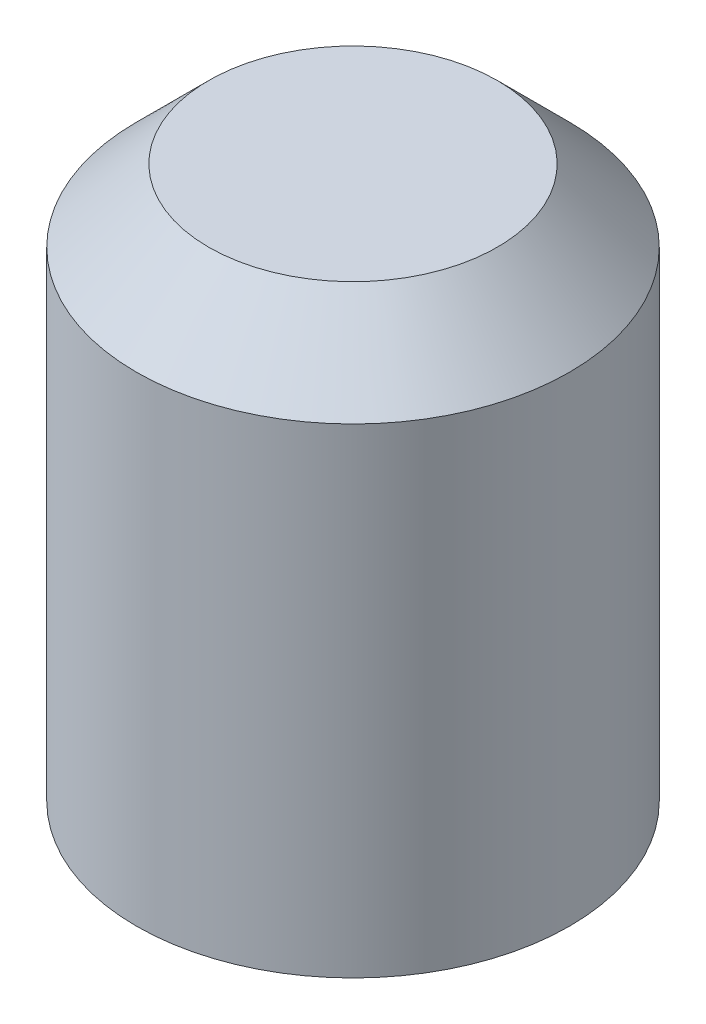
ISO-10303-21;
HEADER;
FILE_DESCRIPTION(('STEP AP214'),'2;1');
FILE_NAME('part.step','',(''),(''),'','','');
FILE_SCHEMA(('AUTOMOTIVE_DESIGN { 1 0 10303 214 1 1 1 1 }'));
ENDSEC;
DATA;
#1=APPLICATION_CONTEXT('core data for automotive mechanical design processes');
#2=APPLICATION_PROTOCOL_DEFINITION('international standard','automotive_design',2000,#1);
#3=PRODUCT_CONTEXT('',#1,'mechanical');
#4=PRODUCT('Part','Part','',(#3));
#5=PRODUCT_RELATED_PRODUCT_CATEGORY('part','',(#4));
#6=PRODUCT_DEFINITION_FORMATION('','',#4);
#7=PRODUCT_DEFINITION_CONTEXT('part definition',#1,'design');
#8=PRODUCT_DEFINITION('design','',#6,#7);
#9=PRODUCT_DEFINITION_SHAPE('','',#8);
#10=(LENGTH_UNIT() NAMED_UNIT(*) SI_UNIT(.MILLI.,.METRE.));
#11=(NAMED_UNIT(*) PLANE_ANGLE_UNIT() SI_UNIT($,.RADIAN.));
#12=(NAMED_UNIT(*) SI_UNIT($,.STERADIAN.) SOLID_ANGLE_UNIT());
#13=UNCERTAINTY_MEASURE_WITH_UNIT(LENGTH_MEASURE(1.E-05),#10,'distance_accuracy_value','');
#14=(GEOMETRIC_REPRESENTATION_CONTEXT(3) GLOBAL_UNCERTAINTY_ASSIGNED_CONTEXT((#13)) GLOBAL_UNIT_ASSIGNED_CONTEXT((#10,
#11,#12)) REPRESENTATION_CONTEXT('',''));
#15=CARTESIAN_POINT('',(0.,0.,0.));
#16=DIRECTION('',(0.,0.,1.));
#17=DIRECTION('',(1.,0.,0.));
#18=AXIS2_PLACEMENT_3D('',#15,#16,#17);
#19=CARTESIAN_POINT('',(5.4,-6.05,0.));
#20=DIRECTION('',(0.,1.,0.));
#21=DIRECTION('',(0.,0.,1.));
#22=AXIS2_PLACEMENT_3D('',#19,#20,#21);
#23=PLANE('',#22);
#24=DIRECTION('',(1.,0.,0.));
#25=VECTOR('',#24,1.);
#26=CARTESIAN_POINT('',(5.83301270189222,-6.05,0.75));
#27=LINE('',#26,#25);
#28=CARTESIAN_POINT('',(5.83301270189222,-6.05,0.75));
#29=VERTEX_POINT('',#28);
#30=CARTESIAN_POINT('',(4.96698729810778,-6.05,0.75));
#31=VERTEX_POINT('',#30);
#32=EDGE_CURVE('E116',#29,#31,#27,.F.);
#33=ORIENTED_EDGE('',*,*,#32,.T.);
#34=DIRECTION('',(0.5,0.,0.866025403784439));
#35=VECTOR('',#34,1.);
#36=CARTESIAN_POINT('',(4.96698729810778,-6.05,0.75));
#37=LINE('',#36,#35);
#38=CARTESIAN_POINT('',(4.53397459621556,-6.05,0.));
#39=VERTEX_POINT('',#38);
#40=EDGE_CURVE('E82',#31,#39,#37,.F.);
#41=ORIENTED_EDGE('',*,*,#40,.T.);
#42=DIRECTION('',(-0.5,0.,0.866025403784439));
#43=VECTOR('',#42,1.);
#44=CARTESIAN_POINT('',(4.53397459621556,-6.05,0.));
#45=LINE('',#44,#43);
#46=CARTESIAN_POINT('',(4.96698729810778,-6.05,-0.75));
#47=VERTEX_POINT('',#46);
#48=EDGE_CURVE('E84',#39,#47,#45,.F.);
#49=ORIENTED_EDGE('',*,*,#48,.T.);
#50=DIRECTION('',(-1.,0.,0.));
#51=VECTOR('',#50,1.);
#52=CARTESIAN_POINT('',(4.96698729810778,-6.05,-0.75));
#53=LINE('',#52,#51);
#54=CARTESIAN_POINT('',(5.83301270189222,-6.05,-0.75));
#55=VERTEX_POINT('',#54);
#56=EDGE_CURVE('E85',#47,#55,#53,.F.);
#57=ORIENTED_EDGE('',*,*,#56,.T.);
#58=DIRECTION('',(-0.5,0.,-0.866025403784439));
#59=VECTOR('',#58,1.);
#60=CARTESIAN_POINT('',(5.83301270189222,-6.05,-0.75));
#61=LINE('',#60,#59);
#62=CARTESIAN_POINT('',(6.26602540378444,-6.05,0.));
#63=VERTEX_POINT('',#62);
#64=EDGE_CURVE('E71',#55,#63,#61,.F.);
#65=ORIENTED_EDGE('',*,*,#64,.T.);
#66=DIRECTION('',(0.5,0.,-0.866025403784439));
#67=VECTOR('',#66,1.);
#68=CARTESIAN_POINT('',(6.26602540378444,-6.05,0.));
#69=LINE('',#68,#67);
#70=EDGE_CURVE('E105',#63,#29,#69,.F.);
#71=ORIENTED_EDGE('',*,*,#70,.T.);
#72=EDGE_LOOP('',(#33,#41,#49,#57,#65,#71));
#73=FACE_BOUND('',#72,.T.);
#74=ADVANCED_FACE('F17',(#73),#23,.F.);
#75=CARTESIAN_POINT('',(4.96698729810778,-7.25,-0.75));
#76=DIRECTION('',(0.,0.,-1.));
#77=DIRECTION('',(-1.,0.,0.));
#78=AXIS2_PLACEMENT_3D('',#75,#76,#77);
#79=PLANE('',#78);
#80=DIRECTION('',(0.,1.,0.));
#81=VECTOR('',#80,1.);
#82=CARTESIAN_POINT('',(5.83301270189222,-7.25,-0.75));
#83=LINE('',#82,#81);
#84=CARTESIAN_POINT('',(5.83301270192332,-7.24999999999689,-0.749999999922893));
#85=VERTEX_POINT('',#84);
#86=EDGE_CURVE('E91',#85,#55,#83,.T.);
#87=ORIENTED_EDGE('',*,*,#86,.T.);
#88=ORIENTED_EDGE('',*,*,#56,.F.);
#89=DIRECTION('',(0.,1.,0.));
#90=VECTOR('',#89,1.);
#91=CARTESIAN_POINT('',(4.96698729810778,-7.25,-0.75));
#92=LINE('',#91,#90);
#93=CARTESIAN_POINT('',(4.96698729813004,-7.25000000000077,-0.749999999961446));
#94=VERTEX_POINT('',#93);
#95=EDGE_CURVE('E58',#47,#94,#92,.F.);
#96=ORIENTED_EDGE('',*,*,#95,.T.);
#97=CARTESIAN_POINT('',(4.96698729813633,-7.25000000002462,-0.749999999990233));
#98=CARTESIAN_POINT('',(5.00253334721182,-7.23973766484959,-0.749999999996492));
#99=CARTESIAN_POINT('',(5.03836059709235,-7.23034220749079,-0.74999999999906));
#100=CARTESIAN_POINT('',(5.11059708571942,-7.21373690239262,-0.750000000000942));
#101=CARTESIAN_POINT('',(5.14700743835464,-7.20653194482124,-0.75000000000025));
#102=CARTESIAN_POINT('',(5.21941958689425,-7.1949455007837,-0.749999999999756));
#103=CARTESIAN_POINT('',(5.25541118774583,-7.19050224024818,-0.749999999999935));
#104=CARTESIAN_POINT('',(5.32760203794008,-7.18453742652163,-0.750000000000065));
#105=CARTESIAN_POINT('',(5.36380101896728,-7.18301270192084,-0.750000000000017));
#106=CARTESIAN_POINT('',(5.43619898102244,-7.18301270192055,-0.749999999999983));
#107=CARTESIAN_POINT('',(5.47239796205041,-7.18453742652112,-0.749999999999995));
#108=CARTESIAN_POINT('',(5.54458881224627,-7.19050224024725,-0.750000000000005));
#109=CARTESIAN_POINT('',(5.58058041309869,-7.19494550078256,-0.750000000000001));
#110=CARTESIAN_POINT('',(5.65299256163985,-7.20653194482036,-0.749999999999999));
#111=CARTESIAN_POINT('',(5.68940291427578,-7.21373690239221,-0.749999999999999));
#112=CARTESIAN_POINT('',(5.76163940290473,-7.23034220748943,-0.750000000000001));
#113=CARTESIAN_POINT('',(5.79746665278644,-7.23973766484681,-0.750000000000001));
#114=CARTESIAN_POINT('',(5.83301270186367,-7.25000000001823,-0.75));
#115=B_SPLINE_CURVE_WITH_KNOTS('',3,(#97,#98,#99,#100,#101,#102,#103,#104,#105,#106,#107,#108,
#109,#110,#111,#112,#113,#114),.UNSPECIFIED.,.F.,.F.,(4,2,2,2,2,2,2,2,4),(0.,0.111027523460429,
0.222301119765627,0.330986572162822,0.439553854962633,0.548121137764763,0.65680659016431,
0.768080186471947,0.879107709934705),.UNSPECIFIED.);
#116=EDGE_CURVE('E20',#94,#85,#115,.T.);
#117=ORIENTED_EDGE('',*,*,#116,.T.);
#118=EDGE_LOOP('',(#87,#88,#96,#117));
#119=FACE_BOUND('',#118,.T.);
#120=ADVANCED_FACE('F89',(#119),#79,.F.);
#121=CARTESIAN_POINT('',(4.53397459621556,-7.25,0.));
#122=DIRECTION('',(-0.866025403784439,0.,-0.5));
#123=DIRECTION('',(-0.5,0.,0.866025403784439));
#124=AXIS2_PLACEMENT_3D('',#121,#122,#123);
#125=PLANE('',#124);
#126=ORIENTED_EDGE('',*,*,#95,.F.);
#127=ORIENTED_EDGE('',*,*,#48,.F.);
#128=DIRECTION('',(0.,1.,0.));
#129=VECTOR('',#128,1.);
#130=CARTESIAN_POINT('',(4.53397459621556,-7.25,0.));
#131=LINE('',#130,#129);
#132=CARTESIAN_POINT('',(4.53397459626008,-7.25000000000077,0.));
#133=VERTEX_POINT('',#132);
#134=EDGE_CURVE('E97',#39,#133,#131,.F.);
#135=ORIENTED_EDGE('',*,*,#134,.T.);
#136=CARTESIAN_POINT('',(4.53397459623829,-7.25000000002462,-1.9843543825902E-11));
#137=CARTESIAN_POINT('',(4.55300288193605,-7.23901082830645,-0.0329579576418098));
#138=CARTESIAN_POINT('',(4.57219541964067,-7.22901675269572,-0.066200408077531));
#139=CARTESIAN_POINT('',(4.61091280108104,-7.21157239453197,-0.133260879872035));
#140=CARTESIAN_POINT('',(4.63043833252598,-7.20412828245994,-0.167080092378077));
#141=CARTESIAN_POINT('',(4.66924742521379,-7.1925409848509,-0.234299412708026));
#142=CARTESIAN_POINT('',(4.68852501685474,-7.18832067044876,-0.267689180878064));
#143=CARTESIAN_POINT('',(4.72717086026949,-7.18328343804382,-0.334625745174027));
#144=CARTESIAN_POINT('',(4.74653897167252,-7.18246234777618,-0.368172298170642));
#145=CARTESIAN_POINT('',(4.78272621006236,-7.1841748588689,-0.430850433647387));
#146=CARTESIAN_POINT('',(4.79955076723974,-7.18628798200753,-0.459991421493473));
#147=CARTESIAN_POINT('',(4.83309027509369,-7.19298398781146,-0.518083553157391));
#148=CARTESIAN_POINT('',(4.84980510985265,-7.19756915558054,-0.547034496200022));
#149=CARTESIAN_POINT('',(4.88341371225657,-7.2090311875406,-0.605246303134992));
#150=CARTESIAN_POINT('',(4.90030322842515,-7.21595661586676,-0.634499803254221));
#151=CARTESIAN_POINT('',(4.93383042648646,-7.23167441034119,-0.692570613731831));
#152=CARTESIAN_POINT('',(4.95046853757001,-7.24046308580387,-0.721388667470523));
#153=CARTESIAN_POINT('',(4.96698729809358,-7.25000000001827,-0.749999999975404));
#154=B_SPLINE_CURVE_WITH_KNOTS('',3,(#136,#137,#138,#139,#140,#141,#142,#143,#144,#145,#146,
#147,#148,#149,#150,#151,#152,#153),.UNSPECIFIED.,.F.,.F.,(4,2,2,2,2,2,2,2,4),(0.,
0.118881004358965,0.238047681439853,0.354265352356804,0.470340333381139,0.571390418521876,
0.672534072698114,0.775920608446916,0.87910424007054),.UNSPECIFIED.);
#155=EDGE_CURVE('E95',#133,#94,#154,.T.);
#156=ORIENTED_EDGE('',*,*,#155,.T.);
#157=EDGE_LOOP('',(#126,#127,#135,#156));
#158=FACE_BOUND('',#157,.T.);
#159=ADVANCED_FACE('F93',(#158),#125,.F.);
#160=CARTESIAN_POINT('',(4.96698729810778,-7.25,0.75));
#161=DIRECTION('',(-0.866025403784439,0.,0.5));
#162=DIRECTION('',(0.5,0.,0.866025403784439));
#163=AXIS2_PLACEMENT_3D('',#160,#161,#162);
#164=PLANE('',#163);
#165=ORIENTED_EDGE('',*,*,#134,.F.);
#166=ORIENTED_EDGE('',*,*,#40,.F.);
#167=DIRECTION('',(0.,1.,0.));
#168=VECTOR('',#167,1.);
#169=CARTESIAN_POINT('',(4.96698729810778,-7.25,0.75));
#170=LINE('',#169,#168);
#171=CARTESIAN_POINT('',(4.96698729813004,-7.25000000000077,0.749999999961446));
#172=VERTEX_POINT('',#171);
#173=EDGE_CURVE('E108',#31,#172,#170,.F.);
#174=ORIENTED_EDGE('',*,*,#173,.T.);
#175=CARTESIAN_POINT('',(4.96698729810196,-7.25000000002462,0.74999999997039));
#176=CARTESIAN_POINT('',(4.94795901239337,-7.23901082830645,0.717042042354683));
#177=CARTESIAN_POINT('',(4.9287664746843,-7.22901675269572,0.683799591921529));
#178=CARTESIAN_POINT('',(4.89004909324067,-7.21157239453197,0.616739120128907));
#179=CARTESIAN_POINT('',(4.87052356179693,-7.20412828245993,0.582919907622172));
#180=CARTESIAN_POINT('',(4.83171446910997,-7.1925409848509,0.51570058729173));
#181=CARTESIAN_POINT('',(4.81243687746872,-7.18832067044876,0.482310819121871));
#182=CARTESIAN_POINT('',(4.77379103405374,-7.18328343804382,0.415374254826037));
#183=CARTESIAN_POINT('',(4.75442292265079,-7.18246234777618,0.381827701829374));
#184=CARTESIAN_POINT('',(4.718235684261,-7.1841748588689,0.319149566352598));
#185=CARTESIAN_POINT('',(4.70141112708361,-7.18628798200753,0.290008578506523));
#186=CARTESIAN_POINT('',(4.66787161922964,-7.19298398781146,0.231916446842613));
#187=CARTESIAN_POINT('',(4.65115678447069,-7.19756915558054,0.202965503799979));
#188=CARTESIAN_POINT('',(4.61754818206677,-7.2090311875406,0.144753696865006));
#189=CARTESIAN_POINT('',(4.60065866589819,-7.21595661586676,0.115500196745777));
#190=CARTESIAN_POINT('',(4.56713146783688,-7.23167441034119,0.0574293862681691));
#191=CARTESIAN_POINT('',(4.55049335675333,-7.24046308580387,0.0286113325294779));
#192=CARTESIAN_POINT('',(4.53397459622976,-7.25000000001827,2.45953700009577E-11));
#193=B_SPLINE_CURVE_WITH_KNOTS('',3,(#175,#176,#177,#178,#179,#180,#181,#182,#183,#184,#185,
#186,#187,#188,#189,#190,#191,#192),.UNSPECIFIED.,.F.,.F.,(4,2,2,2,2,2,2,2,4),(0.,
0.118881004358965,0.238047681439854,0.354265352356804,0.47034033338114,0.571390418521876,
0.672534072698116,0.775920608446918,0.879104240070542),.UNSPECIFIED.);
#194=EDGE_CURVE('E190',#172,#133,#193,.T.);
#195=ORIENTED_EDGE('',*,*,#194,.T.);
#196=EDGE_LOOP('',(#165,#166,#174,#195));
#197=FACE_BOUND('',#196,.T.);
#198=ADVANCED_FACE('F199',(#197),#164,.F.);
#199=CARTESIAN_POINT('',(5.83301270189222,-7.25,0.75));
#200=DIRECTION('',(0.,0.,1.));
#201=DIRECTION('',(1.,0.,0.));
#202=AXIS2_PLACEMENT_3D('',#199,#200,#201);
#203=PLANE('',#202);
#204=ORIENTED_EDGE('',*,*,#173,.F.);
#205=ORIENTED_EDGE('',*,*,#32,.F.);
#206=DIRECTION('',(0.,1.,0.));
#207=VECTOR('',#206,1.);
#208=CARTESIAN_POINT('',(5.83301270189222,-7.25,0.75));
#209=LINE('',#208,#207);
#210=CARTESIAN_POINT('',(5.83301270186996,-7.25000000000788,0.749999999961447));
#211=VERTEX_POINT('',#210);
#212=EDGE_CURVE('E107',#29,#211,#209,.F.);
#213=ORIENTED_EDGE('',*,*,#212,.T.);
#214=CARTESIAN_POINT('',(5.8330127018724,-7.25000000002356,0.749999999995704));
#215=CARTESIAN_POINT('',(5.79746665279532,-7.23973766485022,0.749999999998457));
#216=CARTESIAN_POINT('',(5.7616394029135,-7.23034220749189,0.749999999999586));
#217=CARTESIAN_POINT('',(5.68940291428408,-7.21373690239366,0.750000000000415));
#218=CARTESIAN_POINT('',(5.65299256164779,-7.20653194482176,0.75000000000011));
#219=CARTESIAN_POINT('',(5.58058041310595,-7.19494550078361,0.749999999999893));
#220=CARTESIAN_POINT('',(5.5445888122532,-7.19050224024802,0.749999999999971));
#221=CARTESIAN_POINT('',(5.47239796205666,-7.18453742652144,0.750000000000029));
#222=CARTESIAN_POINT('',(5.43619898102833,-7.18301270192069,0.750000000000008));
#223=CARTESIAN_POINT('',(5.36380101897247,-7.1830127019207,0.749999999999992));
#224=CARTESIAN_POINT('',(5.32760203794494,-7.18453742652139,0.749999999999998));
#225=CARTESIAN_POINT('',(5.25541118774995,-7.19050224024768,0.750000000000002));
#226=CARTESIAN_POINT('',(5.21941958689797,-7.19494550078303,0.750000000000001));
#227=CARTESIAN_POINT('',(5.14700743835774,-7.20653194482082,0.749999999999999));
#228=CARTESIAN_POINT('',(5.11059708572229,-7.21373690239262,0.75));
#229=CARTESIAN_POINT('',(5.0383605970943,-7.23034220748968,0.75));
#230=CARTESIAN_POINT('',(5.00253334721309,-7.23973766484695,0.750000000000001));
#231=CARTESIAN_POINT('',(4.96698729813633,-7.25000000001823,0.75));
#232=B_SPLINE_CURVE_WITH_KNOTS('',3,(#214,#215,#216,#217,#218,#219,#220,#221,#222,#223,#224,
#225,#226,#227,#228,#229,#230,#231),.UNSPECIFIED.,.F.,.F.,(4,2,2,2,2,2,2,2,4),(0.,
0.111027523463793,0.222301119772485,0.330986572173132,0.439553854976335,0.54812113777716,
0.656806590175429,0.768080186481617,0.879107709942884),.UNSPECIFIED.);
#233=EDGE_CURVE('E184',#211,#172,#232,.T.);
#234=ORIENTED_EDGE('',*,*,#233,.T.);
#235=EDGE_LOOP('',(#204,#205,#213,#234));
#236=FACE_BOUND('',#235,.T.);
#237=ADVANCED_FACE('F195',(#236),#203,.F.);
#238=CARTESIAN_POINT('',(6.26602540378444,-7.25,0.));
#239=DIRECTION('',(0.866025403784439,0.,0.5));
#240=DIRECTION('',(0.5,0.,-0.866025403784439));
#241=AXIS2_PLACEMENT_3D('',#238,#239,#240);
#242=PLANE('',#241);
#243=ORIENTED_EDGE('',*,*,#212,.F.);
#244=ORIENTED_EDGE('',*,*,#70,.F.);
#245=DIRECTION('',(0.,1.,0.));
#246=VECTOR('',#245,1.);
#247=CARTESIAN_POINT('',(6.26602540378444,-7.25,0.));
#248=LINE('',#247,#246);
#249=CARTESIAN_POINT('',(6.26602540373992,-7.25000000000077,0.));
#250=VERTEX_POINT('',#249);
#251=EDGE_CURVE('E39',#63,#250,#248,.F.);
#252=ORIENTED_EDGE('',*,*,#251,.T.);
#253=CARTESIAN_POINT('',(6.2660254037617,-7.25000000002462,1.98428895564358E-11));
#254=CARTESIAN_POINT('',(6.24699711806395,-7.23901082830645,0.0329579576418117));
#255=CARTESIAN_POINT('',(6.22780458035932,-7.22901675269572,0.0662004080775355));
#256=CARTESIAN_POINT('',(6.18908719891896,-7.21157239453197,0.133260879872045));
#257=CARTESIAN_POINT('',(6.16956166747401,-7.20412828245993,0.16708009237809));
#258=CARTESIAN_POINT('',(6.1307525747862,-7.1925409848509,0.234299412708039));
#259=CARTESIAN_POINT('',(6.11147498314526,-7.18832067044876,0.267689180878075));
#260=CARTESIAN_POINT('',(6.07282913973051,-7.18328343804382,0.334625745174032));
#261=CARTESIAN_POINT('',(6.05346102832747,-7.18246234777618,0.368172298170644));
#262=CARTESIAN_POINT('',(6.01727378993727,-7.18417485886892,0.430850433648019));
#263=CARTESIAN_POINT('',(6.00044923275953,-7.18628798200762,0.459991421494736));
#264=CARTESIAN_POINT('',(5.96690972490485,-7.1929839878118,0.518083553159906));
#265=CARTESIAN_POINT('',(5.95019489014554,-7.19756915558106,0.547034496203157));
#266=CARTESIAN_POINT('',(5.91658628774089,-7.20903118754156,0.605246303139384));
#267=CARTESIAN_POINT('',(5.89969677157195,-7.215956615868,0.634499803259247));
#268=CARTESIAN_POINT('',(5.86616957350992,-7.23167441034301,0.692570613738103));
#269=CARTESIAN_POINT('',(5.84953146242602,-7.24046308580602,0.721388667477406));
#270=CARTESIAN_POINT('',(5.8330127019021,-7.25000000002077,0.74999999998289));
#271=B_SPLINE_CURVE_WITH_KNOTS('',3,(#253,#254,#255,#256,#257,#258,#259,#260,#261,#262,#263,
#264,#265,#266,#267,#268,#269,#270),.UNSPECIFIED.,.F.,.F.,(4,2,2,2,2,2,2,2,4),(0.,
0.118881004358974,0.238047681439872,0.354265352356813,0.470340333381139,0.571390418524065,
0.672534072702502,0.775920608453615,0.879104240079533),.UNSPECIFIED.);
#272=EDGE_CURVE('E155',#250,#211,#271,.T.);
#273=ORIENTED_EDGE('',*,*,#272,.T.);
#274=EDGE_LOOP('',(#243,#244,#252,#273));
#275=FACE_BOUND('',#274,.T.);
#276=ADVANCED_FACE('F198',(#275),#242,.F.);
#277=CARTESIAN_POINT('',(5.83301270189222,-7.25,-0.75));
#278=DIRECTION('',(0.866025403784439,0.,-0.5));
#279=DIRECTION('',(-0.5,0.,-0.866025403784439));
#280=AXIS2_PLACEMENT_3D('',#277,#278,#279);
#281=PLANE('',#280);
#282=ORIENTED_EDGE('',*,*,#251,.F.);
#283=ORIENTED_EDGE('',*,*,#64,.F.);
#284=ORIENTED_EDGE('',*,*,#86,.F.);
#285=CARTESIAN_POINT('',(5.83301270189804,-7.25000000002462,-0.749999999970391));
#286=CARTESIAN_POINT('',(5.85204098760663,-7.23901082830645,-0.717042042354683));
#287=CARTESIAN_POINT('',(5.8712335253157,-7.22901675269572,-0.68379959192153));
#288=CARTESIAN_POINT('',(5.90995090675933,-7.21157239453197,-0.616739120128908));
#289=CARTESIAN_POINT('',(5.92947643820307,-7.20412828245993,-0.582919907622173));
#290=CARTESIAN_POINT('',(5.96828553089003,-7.1925409848509,-0.515700587291732));
#291=CARTESIAN_POINT('',(5.98756312253128,-7.18832067044876,-0.482310819121872));
#292=CARTESIAN_POINT('',(6.02620896594626,-7.18328343804382,-0.415374254826039));
#293=CARTESIAN_POINT('',(6.04557707734921,-7.18246234777618,-0.381827701829375));
#294=CARTESIAN_POINT('',(6.081764315739,-7.1841748588689,-0.3191495663526));
#295=CARTESIAN_POINT('',(6.09858887291639,-7.18628798200753,-0.290008578506524));
#296=CARTESIAN_POINT('',(6.13212838077036,-7.19298398781146,-0.231916446842614));
#297=CARTESIAN_POINT('',(6.14884321552931,-7.19756915558054,-0.20296550379998));
#298=CARTESIAN_POINT('',(6.18245181793323,-7.2090311875406,-0.144753696865007));
#299=CARTESIAN_POINT('',(6.19934133410181,-7.21595661586676,-0.115500196745779));
#300=CARTESIAN_POINT('',(6.23286853216312,-7.23167441034119,-0.0574293862681703));
#301=CARTESIAN_POINT('',(6.24950664324667,-7.24046308580387,-0.0286113325294789));
#302=CARTESIAN_POINT('',(6.26602540377024,-7.25000000001827,-2.45962206187377E-11));
#303=B_SPLINE_CURVE_WITH_KNOTS('',3,(#285,#286,#287,#288,#289,#290,#291,#292,#293,#294,#295,
#296,#297,#298,#299,#300,#301,#302),.UNSPECIFIED.,.F.,.F.,(4,2,2,2,2,2,2,2,4),(0.,
0.118881004358965,0.238047681439853,0.354265352356803,0.470340333381139,0.571390418521875,
0.672534072698114,0.775920608446916,0.879104240070541),.UNSPECIFIED.);
#304=EDGE_CURVE('E148',#85,#250,#303,.T.);
#305=ORIENTED_EDGE('',*,*,#304,.T.);
#306=EDGE_LOOP('',(#282,#283,#284,#305));
#307=FACE_BOUND('',#306,.T.);
#308=ADVANCED_FACE('F162',(#307),#281,.F.);
#309=CARTESIAN_POINT('',(5.4,-7.24999999994225,0.));
#310=DIRECTION('',(0.,-1.,0.));
#311=DIRECTION('',(0.,0.,-1.));
#312=AXIS2_PLACEMENT_3D('',#309,#310,#311);
#313=CONICAL_SURFACE('',#312,0.866025403638559,1.04719755120955);
#314=ORIENTED_EDGE('',*,*,#116,.F.);
#315=CARTESIAN_POINT('',(5.4,-7.24999999997507,0.));
#316=DIRECTION('',(0.,-1.,0.));
#317=DIRECTION('',(0.,0.,-1.));
#318=AXIS2_PLACEMENT_3D('',#315,#316,#317);
#319=CIRCLE('',#318,0.866025403695403);
#320=EDGE_CURVE('E145',#85,#94,#319,.F.);
#321=ORIENTED_EDGE('',*,*,#320,.F.);
#322=EDGE_LOOP('',(#314,#321));
#323=FACE_BOUND('',#322,.T.);
#324=ADVANCED_FACE('F215',(#323),#313,.F.);
#325=CARTESIAN_POINT('',(5.4,-7.24999999994225,0.));
#326=DIRECTION('',(0.,-1.,0.));
#327=DIRECTION('',(0.,0.,-1.));
#328=AXIS2_PLACEMENT_3D('',#325,#326,#327);
#329=CONICAL_SURFACE('',#328,0.866025403638559,1.04719755134339);
#330=CARTESIAN_POINT('',(5.4,-7.24999999997507,0.));
#331=DIRECTION('',(0.,-1.,0.));
#332=DIRECTION('',(0.,0.,-1.));
#333=AXIS2_PLACEMENT_3D('',#330,#331,#332);
#334=CIRCLE('',#333,0.866025403695403);
#335=EDGE_CURVE('E142',#94,#133,#334,.F.);
#336=ORIENTED_EDGE('',*,*,#335,.F.);
#337=ORIENTED_EDGE('',*,*,#155,.F.);
#338=EDGE_LOOP('',(#336,#337));
#339=FACE_BOUND('',#338,.T.);
#340=ADVANCED_FACE('F212',(#339),#329,.F.);
#341=CARTESIAN_POINT('',(5.4,-7.24999999994225,0.));
#342=DIRECTION('',(0.,-1.,0.));
#343=DIRECTION('',(0.,0.,-1.));
#344=AXIS2_PLACEMENT_3D('',#341,#342,#343);
#345=CONICAL_SURFACE('',#344,0.866025403638559,1.04719755134339);
#346=CARTESIAN_POINT('',(5.4,-7.24999999997507,0.));
#347=DIRECTION('',(0.,-1.,0.));
#348=DIRECTION('',(0.,0.,-1.));
#349=AXIS2_PLACEMENT_3D('',#346,#347,#348);
#350=CIRCLE('',#349,0.866025403695403);
#351=EDGE_CURVE('E139',#133,#172,#350,.F.);
#352=ORIENTED_EDGE('',*,*,#351,.F.);
#353=ORIENTED_EDGE('',*,*,#194,.F.);
#354=EDGE_LOOP('',(#352,#353));
#355=FACE_BOUND('',#354,.T.);
#356=ADVANCED_FACE('F180',(#355),#345,.F.);
#357=CARTESIAN_POINT('',(5.4,-7.24999999994225,0.));
#358=DIRECTION('',(0.,-1.,0.));
#359=DIRECTION('',(0.,0.,-1.));
#360=AXIS2_PLACEMENT_3D('',#357,#358,#359);
#361=CONICAL_SURFACE('',#360,0.866025403638559,1.04719755120955);
#362=ORIENTED_EDGE('',*,*,#233,.F.);
#363=CARTESIAN_POINT('',(5.4,-7.2500000000407,0.));
#364=DIRECTION('',(0.,-1.,0.));
#365=DIRECTION('',(0.,0.,-1.));
#366=AXIS2_PLACEMENT_3D('',#363,#364,#365);
#367=CIRCLE('',#366,0.86602540380909);
#368=EDGE_CURVE('E136',#172,#211,#367,.F.);
#369=ORIENTED_EDGE('',*,*,#368,.F.);
#370=EDGE_LOOP('',(#362,#369));
#371=FACE_BOUND('',#370,.T.);
#372=ADVANCED_FACE('F175',(#371),#361,.F.);
#373=CARTESIAN_POINT('',(5.4,-7.24999999994225,0.));
#374=DIRECTION('',(0.,-1.,0.));
#375=DIRECTION('',(0.,0.,-1.));
#376=AXIS2_PLACEMENT_3D('',#373,#374,#375);
#377=CONICAL_SURFACE('',#376,0.866025403638559,1.04719755134339);
#378=CARTESIAN_POINT('',(5.4,-7.24999999997507,0.));
#379=DIRECTION('',(0.,-1.,0.));
#380=DIRECTION('',(0.,0.,-1.));
#381=AXIS2_PLACEMENT_3D('',#378,#379,#380);
#382=CIRCLE('',#381,0.866025403695403);
#383=EDGE_CURVE('E133',#211,#250,#382,.F.);
#384=ORIENTED_EDGE('',*,*,#383,.F.);
#385=ORIENTED_EDGE('',*,*,#272,.F.);
#386=EDGE_LOOP('',(#384,#385));
#387=FACE_BOUND('',#386,.T.);
#388=ADVANCED_FACE('F169',(#387),#377,.F.);
#389=CARTESIAN_POINT('',(5.4,-7.24999999994225,0.));
#390=DIRECTION('',(0.,-1.,0.));
#391=DIRECTION('',(0.,0.,-1.));
#392=AXIS2_PLACEMENT_3D('',#389,#390,#391);
#393=CONICAL_SURFACE('',#392,0.866025403638559,1.04719755134339);
#394=CARTESIAN_POINT('',(5.4,-7.24999999997507,0.));
#395=DIRECTION('',(0.,-1.,0.));
#396=DIRECTION('',(0.,0.,-1.));
#397=AXIS2_PLACEMENT_3D('',#394,#395,#396);
#398=CIRCLE('',#397,0.866025403695403);
#399=EDGE_CURVE('E130',#250,#85,#398,.F.);
#400=ORIENTED_EDGE('',*,*,#399,.F.);
#401=ORIENTED_EDGE('',*,*,#304,.F.);
#402=EDGE_LOOP('',(#400,#401));
#403=FACE_BOUND('',#402,.T.);
#404=ADVANCED_FACE('F164',(#403),#393,.F.);
#405=CARTESIAN_POINT('',(5.4,-7.25,-1.02976270189222));
#406=DIRECTION('',(0.,-1.,0.));
#407=DIRECTION('',(0.,0.,-1.));
#408=AXIS2_PLACEMENT_3D('',#405,#406,#407);
#409=PLANE('',#408);
#410=ORIENTED_EDGE('',*,*,#383,.T.);
#411=ORIENTED_EDGE('',*,*,#399,.T.);
#412=ORIENTED_EDGE('',*,*,#320,.T.);
#413=ORIENTED_EDGE('',*,*,#335,.T.);
#414=ORIENTED_EDGE('',*,*,#351,.T.);
#415=ORIENTED_EDGE('',*,*,#368,.T.);
#416=EDGE_LOOP('',(#410,#411,#412,#413,#414,#415));
#417=FACE_BOUND('',#416,.T.);
#418=CARTESIAN_POINT('',(5.4,-7.25000000000553,0.));
#419=DIRECTION('',(0.,1.,0.));
#420=DIRECTION('',(0.,0.,1.));
#421=AXIS2_PLACEMENT_3D('',#418,#419,#420);
#422=CIRCLE('',#421,1.1934999999994);
#423=CARTESIAN_POINT('',(5.4,-7.25000000000553,1.1934999999994));
#424=VERTEX_POINT('',#423);
#425=EDGE_CURVE('E127',#424,#424,#422,.T.);
#426=ORIENTED_EDGE('',*,*,#425,.F.);
#427=EDGE_LOOP('',(#426));
#428=FACE_BOUND('',#427,.T.);
#429=ADVANCED_FACE('F168',(#417,#428),#409,.T.);
#430=CARTESIAN_POINT('',(5.4,-3.25,-0.5));
#431=DIRECTION('',(0.,1.,0.));
#432=DIRECTION('',(0.,0.,1.));
#433=AXIS2_PLACEMENT_3D('',#430,#431,#432);
#434=PLANE('',#433);
#435=CARTESIAN_POINT('',(5.4,-3.25000000003683,0.));
#436=DIRECTION('',(0.,-1.,0.));
#437=DIRECTION('',(0.,0.,-1.));
#438=AXIS2_PLACEMENT_3D('',#435,#436,#437);
#439=CIRCLE('',#438,1.00000000014688);
#440=CARTESIAN_POINT('',(5.4,-3.25000000003683,-1.00000000014688));
#441=VERTEX_POINT('',#440);
#442=EDGE_CURVE('E124',#441,#441,#439,.T.);
#443=ORIENTED_EDGE('',*,*,#442,.F.);
#444=EDGE_LOOP('',(#443));
#445=FACE_BOUND('',#444,.T.);
#446=ADVANCED_FACE('F240',(#445),#434,.T.);
#447=CARTESIAN_POINT('',(5.4,-7.07304214262194,0.));
#448=DIRECTION('',(0.,1.,0.));
#449=DIRECTION('',(0.,0.,1.));
#450=AXIS2_PLACEMENT_3D('',#447,#448,#449);
#451=CONICAL_SURFACE('',#450,1.49999999973716,1.04719755112717);
#452=ORIENTED_EDGE('',*,*,#425,.T.);
#453=EDGE_LOOP('',(#452));
#454=FACE_BOUND('',#453,.T.);
#455=CARTESIAN_POINT('',(5.4,-7.07304214249338,0.));
#456=DIRECTION('',(0.,-1.,0.));
#457=DIRECTION('',(0.,0.,-1.));
#458=AXIS2_PLACEMENT_3D('',#455,#456,#457);
#459=CIRCLE('',#458,1.5);
#460=CARTESIAN_POINT('',(5.4,-7.07304214249338,-1.5));
#461=VERTEX_POINT('',#460);
#462=EDGE_CURVE('E30',#461,#461,#459,.F.);
#463=ORIENTED_EDGE('',*,*,#462,.F.);
#464=EDGE_LOOP('',(#463));
#465=FACE_BOUND('',#464,.T.);
#466=ADVANCED_FACE('F233',(#454,#465),#451,.T.);
#467=CARTESIAN_POINT('',(5.4,-3.74999999996817,0.));
#468=DIRECTION('',(0.,-1.,0.));
#469=DIRECTION('',(0.,0.,-1.));
#470=AXIS2_PLACEMENT_3D('',#467,#468,#469);
#471=CONICAL_SURFACE('',#470,1.50000000007822,0.785398163397448);
#472=ORIENTED_EDGE('',*,*,#442,.T.);
#473=EDGE_LOOP('',(#472));
#474=FACE_BOUND('',#473,.T.);
#475=CARTESIAN_POINT('',(5.4,-3.75,0.));
#476=DIRECTION('',(0.,-1.,0.));
#477=DIRECTION('',(0.,0.,-1.));
#478=AXIS2_PLACEMENT_3D('',#475,#476,#477);
#479=CIRCLE('',#478,1.5);
#480=CARTESIAN_POINT('',(5.4,-3.75,-1.5));
#481=VERTEX_POINT('',#480);
#482=EDGE_CURVE('E11',#481,#481,#479,.T.);
#483=ORIENTED_EDGE('',*,*,#482,.F.);
#484=EDGE_LOOP('',(#483));
#485=FACE_BOUND('',#484,.T.);
#486=ADVANCED_FACE('F227',(#474,#485),#471,.T.);
#487=CARTESIAN_POINT('',(5.4,-5.41152107124669,0.));
#488=DIRECTION('',(0.,-1.,0.));
#489=DIRECTION('',(0.,0.,-1.));
#490=AXIS2_PLACEMENT_3D('',#487,#488,#489);
#491=CYLINDRICAL_SURFACE('',#490,1.5);
#492=ORIENTED_EDGE('',*,*,#462,.T.);
#493=EDGE_LOOP('',(#492));
#494=FACE_BOUND('',#493,.T.);
#495=ORIENTED_EDGE('',*,*,#482,.T.);
#496=EDGE_LOOP('',(#495));
#497=FACE_BOUND('',#496,.T.);
#498=ADVANCED_FACE('F225',(#494,#497),#491,.T.);
#499=CLOSED_SHELL('',(#74,#120,#159,#198,#237,#276,#308,#324,#340,#356,#372,#388,#404,#429,#446,
#466,#486,#498));
#500=MANIFOLD_SOLID_BREP('B1',#499);
#501=ADVANCED_BREP_SHAPE_REPRESENTATION('',(#18,#500),#14);
#502=SHAPE_DEFINITION_REPRESENTATION(#9,#501);
ENDSEC;
END-ISO-10303-21;
